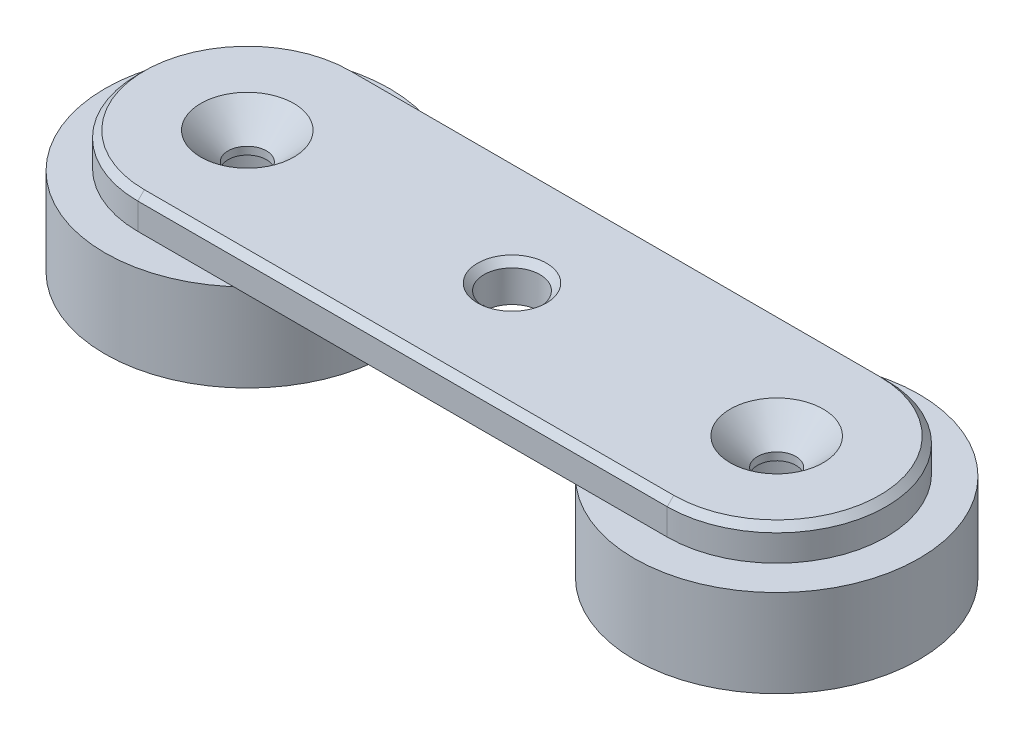
ISO-10303-21;
HEADER;
FILE_DESCRIPTION(('STEP AP214'),'2;1');
FILE_NAME('part.step','',(''),(''),'','','');
FILE_SCHEMA(('AUTOMOTIVE_DESIGN { 1 0 10303 214 1 1 1 1 }'));
ENDSEC;
DATA;
#1=APPLICATION_CONTEXT('core data for automotive mechanical design processes');
#2=APPLICATION_PROTOCOL_DEFINITION('international standard','automotive_design',2000,#1);
#3=PRODUCT_CONTEXT('',#1,'mechanical');
#4=PRODUCT('Part','Part','',(#3));
#5=PRODUCT_RELATED_PRODUCT_CATEGORY('part','',(#4));
#6=PRODUCT_DEFINITION_FORMATION('','',#4);
#7=PRODUCT_DEFINITION_CONTEXT('part definition',#1,'design');
#8=PRODUCT_DEFINITION('design','',#6,#7);
#9=PRODUCT_DEFINITION_SHAPE('','',#8);
#10=(LENGTH_UNIT() NAMED_UNIT(*) SI_UNIT(.MILLI.,.METRE.));
#11=(NAMED_UNIT(*) PLANE_ANGLE_UNIT() SI_UNIT($,.RADIAN.));
#12=(NAMED_UNIT(*) SI_UNIT($,.STERADIAN.) SOLID_ANGLE_UNIT());
#13=UNCERTAINTY_MEASURE_WITH_UNIT(LENGTH_MEASURE(1.E-05),#10,'distance_accuracy_value','');
#14=(GEOMETRIC_REPRESENTATION_CONTEXT(3) GLOBAL_UNCERTAINTY_ASSIGNED_CONTEXT((#13)) GLOBAL_UNIT_ASSIGNED_CONTEXT((#10,
#11,#12)) REPRESENTATION_CONTEXT('',''));
#15=CARTESIAN_POINT('',(0.,0.,0.));
#16=DIRECTION('',(0.,0.,1.));
#17=DIRECTION('',(1.,0.,0.));
#18=AXIS2_PLACEMENT_3D('',#15,#16,#17);
#19=CARTESIAN_POINT('',(24.175,11.4,0.));
#20=DIRECTION('',(0.,1.,0.));
#21=DIRECTION('',(0.,0.,1.));
#22=AXIS2_PLACEMENT_3D('',#19,#20,#21);
#23=PLANE('',#22);
#24=CARTESIAN_POINT('',(-24.175,11.4,0.));
#25=DIRECTION('',(0.,1.,0.));
#26=DIRECTION('',(0.,0.,1.));
#27=AXIS2_PLACEMENT_3D('',#24,#25,#26);
#28=CIRCLE('',#27,7.5);
#29=CARTESIAN_POINT('',(-24.175,11.4,7.50000000000001));
#30=VERTEX_POINT('',#29);
#31=EDGE_CURVE('E190',#30,#30,#28,.F.);
#32=ORIENTED_EDGE('',*,*,#31,.F.);
#33=EDGE_LOOP('',(#32));
#34=FACE_BOUND('',#33,.T.);
#35=CARTESIAN_POINT('',(24.175,11.4,0.));
#36=DIRECTION('',(0.,-1.,0.));
#37=DIRECTION('',(0.,0.,-1.));
#38=AXIS2_PLACEMENT_3D('',#35,#36,#37);
#39=CIRCLE('',#38,7.5);
#40=CARTESIAN_POINT('',(24.175,11.4,-7.50000000000001));
#41=VERTEX_POINT('',#40);
#42=EDGE_CURVE('E187',#41,#41,#39,.T.);
#43=ORIENTED_EDGE('',*,*,#42,.F.);
#44=EDGE_LOOP('',(#43));
#45=FACE_BOUND('',#44,.T.);
#46=DIRECTION('',(-1.,0.,0.));
#47=VECTOR('',#46,1.);
#48=CARTESIAN_POINT('',(10.,11.4,0.));
#49=LINE('',#48,#47);
#50=CARTESIAN_POINT('',(10.,11.4,0.));
#51=VERTEX_POINT('',#50);
#52=CARTESIAN_POINT('',(2.55,11.4,0.));
#53=VERTEX_POINT('',#52);
#54=EDGE_CURVE('E77',#51,#53,#49,.T.);
#55=ORIENTED_EDGE('',*,*,#54,.F.);
#56=CARTESIAN_POINT('',(0.,11.4,0.));
#57=DIRECTION('',(0.,-1.,0.));
#58=DIRECTION('',(0.,0.,-1.));
#59=AXIS2_PLACEMENT_3D('',#56,#57,#58);
#60=CIRCLE('',#59,10.);
#61=CARTESIAN_POINT('',(0.,11.4,-10.));
#62=VERTEX_POINT('',#61);
#63=EDGE_CURVE('E165',#62,#51,#60,.T.);
#64=ORIENTED_EDGE('',*,*,#63,.F.);
#65=DIRECTION('',(-1.,0.,0.));
#66=VECTOR('',#65,1.);
#67=CARTESIAN_POINT('',(24.175,11.4,-10.));
#68=LINE('',#67,#66);
#69=CARTESIAN_POINT('',(24.175,11.4,-10.));
#70=VERTEX_POINT('',#69);
#71=EDGE_CURVE('E197',#70,#62,#68,.T.);
#72=ORIENTED_EDGE('',*,*,#71,.F.);
#73=CARTESIAN_POINT('',(24.175,11.4,0.));
#74=DIRECTION('',(0.,1.,0.));
#75=DIRECTION('',(0.,0.,1.));
#76=AXIS2_PLACEMENT_3D('',#73,#74,#75);
#77=CIRCLE('',#76,10.);
#78=CARTESIAN_POINT('',(24.175,11.4,9.99999999999998));
#79=VERTEX_POINT('',#78);
#80=EDGE_CURVE('E193',#79,#70,#77,.T.);
#81=ORIENTED_EDGE('',*,*,#80,.F.);
#82=DIRECTION('',(1.,0.,0.));
#83=VECTOR('',#82,1.);
#84=CARTESIAN_POINT('',(-24.175,11.4,10.));
#85=LINE('',#84,#83);
#86=CARTESIAN_POINT('',(-24.175,11.4,10.));
#87=VERTEX_POINT('',#86);
#88=EDGE_CURVE('E203',#87,#79,#85,.T.);
#89=ORIENTED_EDGE('',*,*,#88,.F.);
#90=CARTESIAN_POINT('',(-24.175,11.4,0.));
#91=DIRECTION('',(0.,1.,0.));
#92=DIRECTION('',(0.,0.,1.));
#93=AXIS2_PLACEMENT_3D('',#90,#91,#92);
#94=CIRCLE('',#93,10.);
#95=CARTESIAN_POINT('',(-24.175,11.4,-9.99999999999999));
#96=VERTEX_POINT('',#95);
#97=EDGE_CURVE('E200',#96,#87,#94,.T.);
#98=ORIENTED_EDGE('',*,*,#97,.F.);
#99=EDGE_CURVE('E196',#62,#96,#68,.T.);
#100=ORIENTED_EDGE('',*,*,#99,.F.);
#101=CARTESIAN_POINT('',(-9.99999999999998,11.4,0.));
#102=VERTEX_POINT('',#101);
#103=EDGE_CURVE('E84',#102,#62,#60,.T.);
#104=ORIENTED_EDGE('',*,*,#103,.F.);
#105=DIRECTION('',(-1.,0.,0.));
#106=VECTOR('',#105,1.);
#107=CARTESIAN_POINT('',(-2.55,11.4,0.));
#108=LINE('',#107,#106);
#109=CARTESIAN_POINT('',(-2.55,11.4,0.));
#110=VERTEX_POINT('',#109);
#111=EDGE_CURVE('E162',#110,#102,#108,.T.);
#112=ORIENTED_EDGE('',*,*,#111,.F.);
#113=CARTESIAN_POINT('',(0.,11.4,0.));
#114=DIRECTION('',(0.,1.,0.));
#115=DIRECTION('',(0.,0.,1.));
#116=AXIS2_PLACEMENT_3D('',#113,#114,#115);
#117=CIRCLE('',#116,2.55);
#118=EDGE_CURVE('E186',#110,#53,#117,.T.);
#119=ORIENTED_EDGE('',*,*,#118,.T.);
#120=EDGE_LOOP('',(#55,#64,#72,#81,#89,#98,#100,#104,#112,#119));
#121=FACE_BOUND('',#120,.T.);
#122=ADVANCED_FACE('F60',(#34,#45,#121),#23,.F.);
#123=CARTESIAN_POINT('',(24.175,14.4,0.));
#124=DIRECTION('',(0.,1.,0.));
#125=DIRECTION('',(0.,0.,1.));
#126=AXIS2_PLACEMENT_3D('',#123,#124,#125);
#127=PLANE('',#126);
#128=CARTESIAN_POINT('',(-24.175,14.4,0.));
#129=DIRECTION('',(0.,1.,0.));
#130=DIRECTION('',(0.,0.,1.));
#131=AXIS2_PLACEMENT_3D('',#128,#129,#130);
#132=CIRCLE('',#131,9.39999999999999);
#133=CARTESIAN_POINT('',(-24.175,14.4,-9.39999999999998));
#134=VERTEX_POINT('',#133);
#135=CARTESIAN_POINT('',(-24.175,14.4,9.39999999999999));
#136=VERTEX_POINT('',#135);
#137=EDGE_CURVE('E233',#134,#136,#132,.T.);
#138=ORIENTED_EDGE('',*,*,#137,.T.);
#139=DIRECTION('',(1.,0.,0.));
#140=VECTOR('',#139,1.);
#141=CARTESIAN_POINT('',(24.175,14.4,9.39999999999997));
#142=LINE('',#141,#140);
#143=CARTESIAN_POINT('',(24.175,14.4,9.39999999999997));
#144=VERTEX_POINT('',#143);
#145=EDGE_CURVE('E237',#136,#144,#142,.T.);
#146=ORIENTED_EDGE('',*,*,#145,.T.);
#147=CARTESIAN_POINT('',(24.175,14.4,0.));
#148=DIRECTION('',(0.,1.,0.));
#149=DIRECTION('',(0.,0.,1.));
#150=AXIS2_PLACEMENT_3D('',#147,#148,#149);
#151=CIRCLE('',#150,9.39999999999999);
#152=CARTESIAN_POINT('',(24.175,14.4,-9.40000000000001));
#153=VERTEX_POINT('',#152);
#154=EDGE_CURVE('E235',#144,#153,#151,.T.);
#155=ORIENTED_EDGE('',*,*,#154,.T.);
#156=DIRECTION('',(-1.,0.,0.));
#157=VECTOR('',#156,1.);
#158=CARTESIAN_POINT('',(-24.175,14.4,-9.39999999999998));
#159=LINE('',#158,#157);
#160=EDGE_CURVE('E231',#153,#134,#159,.T.);
#161=ORIENTED_EDGE('',*,*,#160,.T.);
#162=EDGE_LOOP('',(#138,#146,#155,#161));
#163=FACE_BOUND('',#162,.T.);
#164=CARTESIAN_POINT('',(0.,14.4,0.));
#165=DIRECTION('',(0.,1.,0.));
#166=DIRECTION('',(0.,0.,1.));
#167=AXIS2_PLACEMENT_3D('',#164,#165,#166);
#168=CIRCLE('',#167,3.14999999999999);
#169=CARTESIAN_POINT('',(0.,14.4,3.15));
#170=VERTEX_POINT('',#169);
#171=EDGE_CURVE('E228',#170,#170,#168,.F.);
#172=ORIENTED_EDGE('',*,*,#171,.T.);
#173=EDGE_LOOP('',(#172));
#174=FACE_BOUND('',#173,.T.);
#175=CARTESIAN_POINT('',(-24.175,14.4,0.));
#176=DIRECTION('',(0.,1.,0.));
#177=DIRECTION('',(0.,0.,1.));
#178=AXIS2_PLACEMENT_3D('',#175,#176,#177);
#179=CIRCLE('',#178,4.25000000000001);
#180=CARTESIAN_POINT('',(-24.175,14.4,4.25000000000002));
#181=VERTEX_POINT('',#180);
#182=EDGE_CURVE('E222',#181,#181,#179,.F.);
#183=ORIENTED_EDGE('',*,*,#182,.T.);
#184=EDGE_LOOP('',(#183));
#185=FACE_BOUND('',#184,.T.);
#186=CARTESIAN_POINT('',(24.175,14.4,0.));
#187=DIRECTION('',(0.,1.,0.));
#188=DIRECTION('',(0.,0.,1.));
#189=AXIS2_PLACEMENT_3D('',#186,#187,#188);
#190=CIRCLE('',#189,4.25000000000001);
#191=CARTESIAN_POINT('',(24.175,14.4,4.25));
#192=VERTEX_POINT('',#191);
#193=EDGE_CURVE('E219',#192,#192,#190,.F.);
#194=ORIENTED_EDGE('',*,*,#193,.T.);
#195=EDGE_LOOP('',(#194));
#196=FACE_BOUND('',#195,.T.);
#197=ADVANCED_FACE('F306',(#163,#174,#185,#196),#127,.T.);
#198=CARTESIAN_POINT('',(24.175,14.4,0.));
#199=DIRECTION('',(0.,-1.,0.));
#200=DIRECTION('',(0.,0.,-1.));
#201=AXIS2_PLACEMENT_3D('',#198,#199,#200);
#202=CYLINDRICAL_SURFACE('',#201,10.);
#203=DIRECTION('',(0.,-1.,0.));
#204=VECTOR('',#203,1.);
#205=CARTESIAN_POINT('',(24.175,14.4,-10.));
#206=LINE('',#205,#204);
#207=CARTESIAN_POINT('',(24.175,13.8,-10.));
#208=VERTEX_POINT('',#207);
#209=EDGE_CURVE('E191',#208,#70,#206,.T.);
#210=ORIENTED_EDGE('',*,*,#209,.F.);
#211=CARTESIAN_POINT('',(24.175,13.8,0.));
#212=DIRECTION('',(0.,1.,0.));
#213=DIRECTION('',(0.,0.,1.));
#214=AXIS2_PLACEMENT_3D('',#211,#212,#213);
#215=CIRCLE('',#214,10.);
#216=CARTESIAN_POINT('',(24.175,13.8,9.99999999999999));
#217=VERTEX_POINT('',#216);
#218=EDGE_CURVE('E243',#208,#217,#215,.F.);
#219=ORIENTED_EDGE('',*,*,#218,.T.);
#220=DIRECTION('',(0.,-1.,0.));
#221=VECTOR('',#220,1.);
#222=CARTESIAN_POINT('',(24.175,14.4,9.99999999999998));
#223=LINE('',#222,#221);
#224=EDGE_CURVE('E206',#217,#79,#223,.T.);
#225=ORIENTED_EDGE('',*,*,#224,.T.);
#226=ORIENTED_EDGE('',*,*,#80,.T.);
#227=EDGE_LOOP('',(#210,#219,#225,#226));
#228=FACE_BOUND('',#227,.T.);
#229=ADVANCED_FACE('F271',(#228),#202,.T.);
#230=CARTESIAN_POINT('',(24.175,14.4,-10.));
#231=DIRECTION('',(0.,0.,1.));
#232=DIRECTION('',(1.,0.,0.));
#233=AXIS2_PLACEMENT_3D('',#230,#231,#232);
#234=PLANE('',#233);
#235=DIRECTION('',(0.,-1.,0.));
#236=VECTOR('',#235,1.);
#237=CARTESIAN_POINT('',(-24.175,14.4,-9.99999999999999));
#238=LINE('',#237,#236);
#239=CARTESIAN_POINT('',(-24.175,13.8,-10.));
#240=VERTEX_POINT('',#239);
#241=EDGE_CURVE('E210',#240,#96,#238,.T.);
#242=ORIENTED_EDGE('',*,*,#241,.F.);
#243=DIRECTION('',(1.,0.,0.));
#244=VECTOR('',#243,1.);
#245=CARTESIAN_POINT('',(24.175,13.8,-10.));
#246=LINE('',#245,#244);
#247=EDGE_CURVE('E69',#240,#208,#246,.T.);
#248=ORIENTED_EDGE('',*,*,#247,.T.);
#249=ORIENTED_EDGE('',*,*,#209,.T.);
#250=ORIENTED_EDGE('',*,*,#71,.T.);
#251=ORIENTED_EDGE('',*,*,#99,.T.);
#252=EDGE_LOOP('',(#242,#248,#249,#250,#251));
#253=FACE_BOUND('',#252,.T.);
#254=ADVANCED_FACE('F268',(#253),#234,.F.);
#255=CARTESIAN_POINT('',(-24.175,14.4,0.));
#256=DIRECTION('',(0.,-1.,0.));
#257=DIRECTION('',(0.,0.,-1.));
#258=AXIS2_PLACEMENT_3D('',#255,#256,#257);
#259=CYLINDRICAL_SURFACE('',#258,10.);
#260=DIRECTION('',(0.,-1.,0.));
#261=VECTOR('',#260,1.);
#262=CARTESIAN_POINT('',(-24.175,14.4,10.));
#263=LINE('',#262,#261);
#264=CARTESIAN_POINT('',(-24.175,13.8,9.99999999999999));
#265=VERTEX_POINT('',#264);
#266=EDGE_CURVE('E208',#265,#87,#263,.T.);
#267=ORIENTED_EDGE('',*,*,#266,.F.);
#268=CARTESIAN_POINT('',(-24.175,13.8,0.));
#269=DIRECTION('',(0.,1.,0.));
#270=DIRECTION('',(0.,0.,1.));
#271=AXIS2_PLACEMENT_3D('',#268,#269,#270);
#272=CIRCLE('',#271,10.);
#273=EDGE_CURVE('E245',#265,#240,#272,.F.);
#274=ORIENTED_EDGE('',*,*,#273,.T.);
#275=ORIENTED_EDGE('',*,*,#241,.T.);
#276=ORIENTED_EDGE('',*,*,#97,.T.);
#277=EDGE_LOOP('',(#267,#274,#275,#276));
#278=FACE_BOUND('',#277,.T.);
#279=ADVANCED_FACE('F301',(#278),#259,.T.);
#280=CARTESIAN_POINT('',(-24.175,14.4,10.));
#281=DIRECTION('',(0.,0.,-1.));
#282=DIRECTION('',(-1.,0.,0.));
#283=AXIS2_PLACEMENT_3D('',#280,#281,#282);
#284=PLANE('',#283);
#285=ORIENTED_EDGE('',*,*,#224,.F.);
#286=DIRECTION('',(-1.,0.,0.));
#287=VECTOR('',#286,1.);
#288=CARTESIAN_POINT('',(-24.175,13.8,9.99999999999999));
#289=LINE('',#288,#287);
#290=EDGE_CURVE('E240',#217,#265,#289,.T.);
#291=ORIENTED_EDGE('',*,*,#290,.T.);
#292=ORIENTED_EDGE('',*,*,#266,.T.);
#293=ORIENTED_EDGE('',*,*,#88,.T.);
#294=EDGE_LOOP('',(#285,#291,#292,#293));
#295=FACE_BOUND('',#294,.T.);
#296=ADVANCED_FACE('F291',(#295),#284,.F.);
#297=CARTESIAN_POINT('',(0.,14.4,0.));
#298=DIRECTION('',(0.,-1.,0.));
#299=DIRECTION('',(0.,0.,-1.));
#300=AXIS2_PLACEMENT_3D('',#297,#298,#299);
#301=CYLINDRICAL_SURFACE('',#300,2.55);
#302=CARTESIAN_POINT('',(0.,13.8,0.));
#303=DIRECTION('',(0.,1.,0.));
#304=DIRECTION('',(0.,0.,1.));
#305=AXIS2_PLACEMENT_3D('',#302,#303,#304);
#306=CIRCLE('',#305,2.55);
#307=CARTESIAN_POINT('',(0.,13.8,2.55));
#308=VERTEX_POINT('',#307);
#309=EDGE_CURVE('E14',#308,#308,#306,.T.);
#310=ORIENTED_EDGE('',*,*,#309,.T.);
#311=EDGE_LOOP('',(#310));
#312=FACE_BOUND('',#311,.T.);
#313=ORIENTED_EDGE('',*,*,#118,.F.);
#314=DIRECTION('',(0.,1.,0.));
#315=VECTOR('',#314,1.);
#316=CARTESIAN_POINT('',(-2.55,10.9,0.));
#317=LINE('',#316,#315);
#318=CARTESIAN_POINT('',(-2.55,10.9,0.));
#319=VERTEX_POINT('',#318);
#320=EDGE_CURVE('E170',#319,#110,#317,.T.);
#321=ORIENTED_EDGE('',*,*,#320,.F.);
#322=CARTESIAN_POINT('',(0.,10.9,0.));
#323=DIRECTION('',(0.,1.,0.));
#324=DIRECTION('',(0.,0.,-1.));
#325=AXIS2_PLACEMENT_3D('',#322,#323,#324);
#326=CIRCLE('',#325,2.55);
#327=CARTESIAN_POINT('',(2.55,10.9,0.));
#328=VERTEX_POINT('',#327);
#329=EDGE_CURVE('E152',#328,#319,#326,.T.);
#330=ORIENTED_EDGE('',*,*,#329,.F.);
#331=DIRECTION('',(0.,1.,0.));
#332=VECTOR('',#331,1.);
#333=CARTESIAN_POINT('',(2.55,10.9,0.));
#334=LINE('',#333,#332);
#335=EDGE_CURVE('E149',#328,#53,#334,.T.);
#336=ORIENTED_EDGE('',*,*,#335,.T.);
#337=EDGE_LOOP('',(#313,#321,#330,#336));
#338=FACE_BOUND('',#337,.T.);
#339=ADVANCED_FACE('F288',(#312,#338),#301,.F.);
#340=CARTESIAN_POINT('',(-24.175,14.4,0.));
#341=DIRECTION('',(0.,-1.,0.));
#342=DIRECTION('',(0.,0.,-1.));
#343=AXIS2_PLACEMENT_3D('',#340,#341,#342);
#344=CYLINDRICAL_SURFACE('',#343,1.75);
#345=CARTESIAN_POINT('',(-24.175,11.9,0.));
#346=DIRECTION('',(0.,1.,0.));
#347=DIRECTION('',(0.,0.,1.));
#348=AXIS2_PLACEMENT_3D('',#345,#346,#347);
#349=CIRCLE('',#348,1.75);
#350=CARTESIAN_POINT('',(-24.175,11.9,1.75000000000001));
#351=VERTEX_POINT('',#350);
#352=EDGE_CURVE('E216',#351,#351,#349,.T.);
#353=ORIENTED_EDGE('',*,*,#352,.T.);
#354=EDGE_LOOP('',(#353));
#355=FACE_BOUND('',#354,.T.);
#356=CARTESIAN_POINT('',(-24.175,11.2,0.));
#357=DIRECTION('',(0.,-1.,0.));
#358=DIRECTION('',(0.,0.,-1.));
#359=AXIS2_PLACEMENT_3D('',#356,#357,#358);
#360=CIRCLE('',#359,1.75);
#361=CARTESIAN_POINT('',(-24.175,11.2,-1.74999999999999));
#362=VERTEX_POINT('',#361);
#363=EDGE_CURVE('E174',#362,#362,#360,.T.);
#364=ORIENTED_EDGE('',*,*,#363,.T.);
#365=EDGE_LOOP('',(#364));
#366=FACE_BOUND('',#365,.T.);
#367=ADVANCED_FACE('F290',(#355,#366),#344,.F.);
#368=CARTESIAN_POINT('',(24.175,14.4,0.));
#369=DIRECTION('',(0.,-1.,0.));
#370=DIRECTION('',(0.,0.,-1.));
#371=AXIS2_PLACEMENT_3D('',#368,#369,#370);
#372=CYLINDRICAL_SURFACE('',#371,1.75);
#373=CARTESIAN_POINT('',(24.175,11.9,0.));
#374=DIRECTION('',(0.,1.,0.));
#375=DIRECTION('',(0.,0.,1.));
#376=AXIS2_PLACEMENT_3D('',#373,#374,#375);
#377=CIRCLE('',#376,1.75);
#378=CARTESIAN_POINT('',(24.175,11.9,1.74999999999999));
#379=VERTEX_POINT('',#378);
#380=EDGE_CURVE('E225',#379,#379,#377,.T.);
#381=ORIENTED_EDGE('',*,*,#380,.T.);
#382=EDGE_LOOP('',(#381));
#383=FACE_BOUND('',#382,.T.);
#384=CARTESIAN_POINT('',(24.175,11.2,0.));
#385=DIRECTION('',(0.,-1.,0.));
#386=DIRECTION('',(0.,0.,-1.));
#387=AXIS2_PLACEMENT_3D('',#384,#385,#386);
#388=CIRCLE('',#387,1.75);
#389=CARTESIAN_POINT('',(24.175,11.2,-1.75000000000001));
#390=VERTEX_POINT('',#389);
#391=EDGE_CURVE('E180',#390,#390,#388,.T.);
#392=ORIENTED_EDGE('',*,*,#391,.T.);
#393=EDGE_LOOP('',(#392));
#394=FACE_BOUND('',#393,.T.);
#395=ADVANCED_FACE('F298',(#383,#394),#372,.F.);
#396=CARTESIAN_POINT('',(24.175,11.2,0.));
#397=DIRECTION('',(0.,-1.,0.));
#398=DIRECTION('',(0.,0.,-1.));
#399=AXIS2_PLACEMENT_3D('',#396,#397,#398);
#400=PLANE('',#399);
#401=CARTESIAN_POINT('',(24.175,11.2,0.));
#402=DIRECTION('',(0.,-1.,0.));
#403=DIRECTION('',(0.,0.,-1.));
#404=AXIS2_PLACEMENT_3D('',#401,#402,#403);
#405=CIRCLE('',#404,7.5);
#406=CARTESIAN_POINT('',(24.175,11.2,-7.50000000000001));
#407=VERTEX_POINT('',#406);
#408=EDGE_CURVE('E183',#407,#407,#405,.T.);
#409=ORIENTED_EDGE('',*,*,#408,.T.);
#410=EDGE_LOOP('',(#409));
#411=FACE_BOUND('',#410,.T.);
#412=ORIENTED_EDGE('',*,*,#391,.F.);
#413=EDGE_LOOP('',(#412));
#414=FACE_BOUND('',#413,.T.);
#415=ADVANCED_FACE('F398',(#411,#414),#400,.T.);
#416=CARTESIAN_POINT('',(24.175,11.2,0.));
#417=DIRECTION('',(0.,1.,0.));
#418=DIRECTION('',(0.,0.,1.));
#419=AXIS2_PLACEMENT_3D('',#416,#417,#418);
#420=CYLINDRICAL_SURFACE('',#419,7.5);
#421=ORIENTED_EDGE('',*,*,#408,.F.);
#422=EDGE_LOOP('',(#421));
#423=FACE_BOUND('',#422,.T.);
#424=ORIENTED_EDGE('',*,*,#42,.T.);
#425=EDGE_LOOP('',(#424));
#426=FACE_BOUND('',#425,.T.);
#427=ADVANCED_FACE('F393',(#423,#426),#420,.T.);
#428=CARTESIAN_POINT('',(-24.175,11.2,0.));
#429=DIRECTION('',(0.,-1.,0.));
#430=DIRECTION('',(0.,0.,-1.));
#431=AXIS2_PLACEMENT_3D('',#428,#429,#430);
#432=PLANE('',#431);
#433=CARTESIAN_POINT('',(-24.175,11.2,0.));
#434=DIRECTION('',(0.,-1.,0.));
#435=DIRECTION('',(0.,0.,-1.));
#436=AXIS2_PLACEMENT_3D('',#433,#434,#435);
#437=CIRCLE('',#436,7.5);
#438=CARTESIAN_POINT('',(-24.175,11.2,-7.49999999999999));
#439=VERTEX_POINT('',#438);
#440=EDGE_CURVE('E177',#439,#439,#437,.T.);
#441=ORIENTED_EDGE('',*,*,#440,.T.);
#442=EDGE_LOOP('',(#441));
#443=FACE_BOUND('',#442,.T.);
#444=ORIENTED_EDGE('',*,*,#363,.F.);
#445=EDGE_LOOP('',(#444));
#446=FACE_BOUND('',#445,.T.);
#447=ADVANCED_FACE('F390',(#443,#446),#432,.T.);
#448=CARTESIAN_POINT('',(-24.175,11.2,0.));
#449=DIRECTION('',(0.,1.,0.));
#450=DIRECTION('',(0.,0.,1.));
#451=AXIS2_PLACEMENT_3D('',#448,#449,#450);
#452=CYLINDRICAL_SURFACE('',#451,7.5);
#453=ORIENTED_EDGE('',*,*,#440,.F.);
#454=EDGE_LOOP('',(#453));
#455=FACE_BOUND('',#454,.T.);
#456=ORIENTED_EDGE('',*,*,#31,.T.);
#457=EDGE_LOOP('',(#456));
#458=FACE_BOUND('',#457,.T.);
#459=ADVANCED_FACE('F327',(#455,#458),#452,.T.);
#460=CARTESIAN_POINT('',(-24.175,11.9,0.));
#461=DIRECTION('',(0.,1.,0.));
#462=DIRECTION('',(0.,0.,1.));
#463=AXIS2_PLACEMENT_3D('',#460,#461,#462);
#464=CONICAL_SURFACE('',#463,1.75,0.78539816339745);
#465=ORIENTED_EDGE('',*,*,#182,.F.);
#466=EDGE_LOOP('',(#465));
#467=FACE_BOUND('',#466,.T.);
#468=ORIENTED_EDGE('',*,*,#352,.F.);
#469=EDGE_LOOP('',(#468));
#470=FACE_BOUND('',#469,.T.);
#471=ADVANCED_FACE('F323',(#467,#470),#464,.F.);
#472=CARTESIAN_POINT('',(24.175,11.9,0.));
#473=DIRECTION('',(0.,1.,0.));
#474=DIRECTION('',(0.,0.,1.));
#475=AXIS2_PLACEMENT_3D('',#472,#473,#474);
#476=CONICAL_SURFACE('',#475,1.75,0.78539816339745);
#477=ORIENTED_EDGE('',*,*,#193,.F.);
#478=EDGE_LOOP('',(#477));
#479=FACE_BOUND('',#478,.T.);
#480=ORIENTED_EDGE('',*,*,#380,.F.);
#481=EDGE_LOOP('',(#480));
#482=FACE_BOUND('',#481,.T.);
#483=ADVANCED_FACE('F326',(#479,#482),#476,.F.);
#484=CARTESIAN_POINT('',(24.175,14.4,-9.40000000000001));
#485=DIRECTION('',(0.,0.707106781186543,-0.707106781186552));
#486=DIRECTION('',(1.,0.,0.));
#487=AXIS2_PLACEMENT_3D('',#484,#485,#486);
#488=PLANE('',#487);
#489=DIRECTION('',(0.,0.707106781186552,0.707106781186543));
#490=VECTOR('',#489,1.);
#491=CARTESIAN_POINT('',(24.175,13.8,-10.));
#492=LINE('',#491,#490);
#493=EDGE_CURVE('E248',#208,#153,#492,.T.);
#494=ORIENTED_EDGE('',*,*,#493,.F.);
#495=ORIENTED_EDGE('',*,*,#247,.F.);
#496=DIRECTION('',(0.,-0.707106781186552,-0.707106781186543));
#497=VECTOR('',#496,1.);
#498=CARTESIAN_POINT('',(-24.175,14.4,-9.39999999999998));
#499=LINE('',#498,#497);
#500=EDGE_CURVE('E64',#134,#240,#499,.T.);
#501=ORIENTED_EDGE('',*,*,#500,.F.);
#502=ORIENTED_EDGE('',*,*,#160,.F.);
#503=EDGE_LOOP('',(#494,#495,#501,#502));
#504=FACE_BOUND('',#503,.T.);
#505=ADVANCED_FACE('F264',(#504),#488,.T.);
#506=CARTESIAN_POINT('',(-24.175,14.4,0.));
#507=DIRECTION('',(0.,-1.,0.));
#508=DIRECTION('',(0.,0.,-1.));
#509=AXIS2_PLACEMENT_3D('',#506,#507,#508);
#510=CONICAL_SURFACE('',#509,9.39999999999999,0.785398163397443);
#511=ORIENTED_EDGE('',*,*,#500,.T.);
#512=ORIENTED_EDGE('',*,*,#273,.F.);
#513=DIRECTION('',(0.,-0.707106781186552,0.707106781186543));
#514=VECTOR('',#513,1.);
#515=CARTESIAN_POINT('',(-24.175,14.4,9.39999999999999));
#516=LINE('',#515,#514);
#517=EDGE_CURVE('E168',#136,#265,#516,.T.);
#518=ORIENTED_EDGE('',*,*,#517,.F.);
#519=ORIENTED_EDGE('',*,*,#137,.F.);
#520=EDGE_LOOP('',(#511,#512,#518,#519));
#521=FACE_BOUND('',#520,.T.);
#522=ADVANCED_FACE('F259',(#521),#510,.T.);
#523=CARTESIAN_POINT('',(24.175,14.4,0.));
#524=DIRECTION('',(0.,-1.,0.));
#525=DIRECTION('',(0.,0.,-1.));
#526=AXIS2_PLACEMENT_3D('',#523,#524,#525);
#527=CONICAL_SURFACE('',#526,9.39999999999999,0.785398163397443);
#528=ORIENTED_EDGE('',*,*,#493,.T.);
#529=ORIENTED_EDGE('',*,*,#154,.F.);
#530=DIRECTION('',(0.,0.707106781186552,-0.707106781186543));
#531=VECTOR('',#530,1.);
#532=CARTESIAN_POINT('',(24.175,13.8,9.99999999999999));
#533=LINE('',#532,#531);
#534=EDGE_CURVE('E166',#217,#144,#533,.T.);
#535=ORIENTED_EDGE('',*,*,#534,.F.);
#536=ORIENTED_EDGE('',*,*,#218,.F.);
#537=EDGE_LOOP('',(#528,#529,#535,#536));
#538=FACE_BOUND('',#537,.T.);
#539=ADVANCED_FACE('F335',(#538),#527,.T.);
#540=CARTESIAN_POINT('',(24.175,14.4,9.39999999999997));
#541=DIRECTION('',(0.,0.707106781186543,0.707106781186552));
#542=DIRECTION('',(-1.,0.,0.));
#543=AXIS2_PLACEMENT_3D('',#540,#541,#542);
#544=PLANE('',#543);
#545=ORIENTED_EDGE('',*,*,#517,.T.);
#546=ORIENTED_EDGE('',*,*,#290,.F.);
#547=ORIENTED_EDGE('',*,*,#534,.T.);
#548=ORIENTED_EDGE('',*,*,#145,.F.);
#549=EDGE_LOOP('',(#545,#546,#547,#548));
#550=FACE_BOUND('',#549,.T.);
#551=ADVANCED_FACE('F332',(#550),#544,.T.);
#552=CARTESIAN_POINT('',(0.,13.8,0.));
#553=DIRECTION('',(0.,1.,0.));
#554=DIRECTION('',(0.,0.,1.));
#555=AXIS2_PLACEMENT_3D('',#552,#553,#554);
#556=CONICAL_SURFACE('',#555,2.55,0.785398163397449);
#557=ORIENTED_EDGE('',*,*,#171,.F.);
#558=EDGE_LOOP('',(#557));
#559=FACE_BOUND('',#558,.T.);
#560=ORIENTED_EDGE('',*,*,#309,.F.);
#561=EDGE_LOOP('',(#560));
#562=FACE_BOUND('',#561,.T.);
#563=ADVANCED_FACE('F62',(#559,#562),#556,.F.);
#564=CARTESIAN_POINT('',(0.,10.9,0.));
#565=DIRECTION('',(0.,1.,0.));
#566=DIRECTION('',(0.,0.,1.));
#567=AXIS2_PLACEMENT_3D('',#564,#565,#566);
#568=CYLINDRICAL_SURFACE('',#567,10.);
#569=ORIENTED_EDGE('',*,*,#103,.T.);
#570=ORIENTED_EDGE('',*,*,#63,.T.);
#571=DIRECTION('',(0.,1.,0.));
#572=VECTOR('',#571,1.);
#573=CARTESIAN_POINT('',(10.,10.9,0.));
#574=LINE('',#573,#572);
#575=CARTESIAN_POINT('',(10.,10.9,0.));
#576=VERTEX_POINT('',#575);
#577=EDGE_CURVE('E147',#576,#51,#574,.T.);
#578=ORIENTED_EDGE('',*,*,#577,.F.);
#579=CARTESIAN_POINT('',(0.,10.9,0.));
#580=DIRECTION('',(0.,-1.,0.));
#581=DIRECTION('',(0.,0.,-1.));
#582=AXIS2_PLACEMENT_3D('',#579,#580,#581);
#583=CIRCLE('',#582,10.);
#584=CARTESIAN_POINT('',(-9.99999999999999,10.9,0.));
#585=VERTEX_POINT('',#584);
#586=EDGE_CURVE('E153',#585,#576,#583,.T.);
#587=ORIENTED_EDGE('',*,*,#586,.F.);
#588=DIRECTION('',(0.,1.,0.));
#589=VECTOR('',#588,1.);
#590=CARTESIAN_POINT('',(-9.99999999999999,10.9,0.));
#591=LINE('',#590,#589);
#592=EDGE_CURVE('E276',#585,#102,#591,.T.);
#593=ORIENTED_EDGE('',*,*,#592,.T.);
#594=EDGE_LOOP('',(#569,#570,#578,#587,#593));
#595=FACE_BOUND('',#594,.T.);
#596=ADVANCED_FACE('F164',(#595),#568,.T.);
#597=CARTESIAN_POINT('',(10.,10.9,0.));
#598=DIRECTION('',(0.,0.,-1.));
#599=DIRECTION('',(-1.,0.,0.));
#600=AXIS2_PLACEMENT_3D('',#597,#598,#599);
#601=PLANE('',#600);
#602=ORIENTED_EDGE('',*,*,#54,.T.);
#603=ORIENTED_EDGE('',*,*,#335,.F.);
#604=DIRECTION('',(-1.,0.,0.));
#605=VECTOR('',#604,1.);
#606=CARTESIAN_POINT('',(10.,10.9,0.));
#607=LINE('',#606,#605);
#608=EDGE_CURVE('E143',#576,#328,#607,.T.);
#609=ORIENTED_EDGE('',*,*,#608,.F.);
#610=ORIENTED_EDGE('',*,*,#577,.T.);
#611=EDGE_LOOP('',(#602,#603,#609,#610));
#612=FACE_BOUND('',#611,.T.);
#613=ADVANCED_FACE('F145',(#612),#601,.F.);
#614=CARTESIAN_POINT('',(-2.55,10.9,0.));
#615=DIRECTION('',(0.,0.,-1.));
#616=DIRECTION('',(-1.,0.,0.));
#617=AXIS2_PLACEMENT_3D('',#614,#615,#616);
#618=PLANE('',#617);
#619=ORIENTED_EDGE('',*,*,#111,.T.);
#620=ORIENTED_EDGE('',*,*,#592,.F.);
#621=DIRECTION('',(-1.,0.,0.));
#622=VECTOR('',#621,1.);
#623=CARTESIAN_POINT('',(-2.55,10.9,0.));
#624=LINE('',#623,#622);
#625=EDGE_CURVE('E158',#319,#585,#624,.T.);
#626=ORIENTED_EDGE('',*,*,#625,.F.);
#627=ORIENTED_EDGE('',*,*,#320,.T.);
#628=EDGE_LOOP('',(#619,#620,#626,#627));
#629=FACE_BOUND('',#628,.T.);
#630=ADVANCED_FACE('F286',(#629),#618,.F.);
#631=CARTESIAN_POINT('',(0.,10.9,0.));
#632=DIRECTION('',(0.,-1.,0.));
#633=DIRECTION('',(0.,0.,-1.));
#634=AXIS2_PLACEMENT_3D('',#631,#632,#633);
#635=PLANE('',#634);
#636=ORIENTED_EDGE('',*,*,#586,.T.);
#637=ORIENTED_EDGE('',*,*,#608,.T.);
#638=ORIENTED_EDGE('',*,*,#329,.T.);
#639=ORIENTED_EDGE('',*,*,#625,.T.);
#640=EDGE_LOOP('',(#636,#637,#638,#639));
#641=FACE_BOUND('',#640,.T.);
#642=ADVANCED_FACE('F156',(#641),#635,.T.);
#643=CLOSED_SHELL('',(#122,#197,#229,#254,#279,#296,#339,#367,#395,#415,#427,#447,#459,#471,
#483,#505,#522,#539,#551,#563,#596,#613,#630,#642));
#644=MANIFOLD_SOLID_BREP('B2',#643);
#645=CARTESIAN_POINT('',(24.175,11.2,0.));
#646=DIRECTION('',(0.,1.,0.));
#647=DIRECTION('',(0.,0.,1.));
#648=AXIS2_PLACEMENT_3D('',#645,#646,#647);
#649=PLANE('',#648);
#650=CARTESIAN_POINT('',(24.175,11.2,0.));
#651=DIRECTION('',(0.,-1.,0.));
#652=DIRECTION('',(0.,0.,1.));
#653=AXIS2_PLACEMENT_3D('',#650,#651,#652);
#654=CIRCLE('',#653,13.);
#655=CARTESIAN_POINT('',(24.175,11.2,13.));
#656=VERTEX_POINT('',#655);
#657=EDGE_CURVE('E59',#656,#656,#654,.T.);
#658=ORIENTED_EDGE('',*,*,#657,.F.);
#659=EDGE_LOOP('',(#658));
#660=FACE_BOUND('',#659,.T.);
#661=CARTESIAN_POINT('',(24.175,11.2,0.));
#662=DIRECTION('',(0.,-1.,0.));
#663=DIRECTION('',(0.,0.,1.));
#664=AXIS2_PLACEMENT_3D('',#661,#662,#663);
#665=CIRCLE('',#664,5.);
#666=CARTESIAN_POINT('',(24.175,11.2,5.00000000000001));
#667=VERTEX_POINT('',#666);
#668=EDGE_CURVE('E517',#667,#667,#665,.T.);
#669=ORIENTED_EDGE('',*,*,#668,.T.);
#670=EDGE_LOOP('',(#669));
#671=FACE_BOUND('',#670,.T.);
#672=ADVANCED_FACE('F506',(#660,#671),#649,.T.);
#673=CARTESIAN_POINT('',(24.175,3.2,0.));
#674=DIRECTION('',(0.,1.,0.));
#675=DIRECTION('',(0.,0.,1.));
#676=AXIS2_PLACEMENT_3D('',#673,#674,#675);
#677=PLANE('',#676);
#678=CARTESIAN_POINT('',(24.175,3.2,0.));
#679=DIRECTION('',(0.,-1.,0.));
#680=DIRECTION('',(0.,0.,1.));
#681=AXIS2_PLACEMENT_3D('',#678,#679,#680);
#682=CIRCLE('',#681,13.);
#683=CARTESIAN_POINT('',(24.175,3.2,13.));
#684=VERTEX_POINT('',#683);
#685=EDGE_CURVE('E510',#684,#684,#682,.T.);
#686=ORIENTED_EDGE('',*,*,#685,.T.);
#687=EDGE_LOOP('',(#686));
#688=FACE_BOUND('',#687,.T.);
#689=CARTESIAN_POINT('',(24.175,3.2,0.));
#690=DIRECTION('',(0.,-1.,0.));
#691=DIRECTION('',(0.,0.,1.));
#692=AXIS2_PLACEMENT_3D('',#689,#690,#691);
#693=CIRCLE('',#692,5.);
#694=CARTESIAN_POINT('',(24.175,3.2,5.00000000000001));
#695=VERTEX_POINT('',#694);
#696=EDGE_CURVE('E519',#695,#695,#693,.T.);
#697=ORIENTED_EDGE('',*,*,#696,.F.);
#698=EDGE_LOOP('',(#697));
#699=FACE_BOUND('',#698,.T.);
#700=ADVANCED_FACE('F532',(#688,#699),#677,.F.);
#701=CARTESIAN_POINT('',(24.175,11.2,0.));
#702=DIRECTION('',(0.,-1.,0.));
#703=DIRECTION('',(0.,0.,-1.));
#704=AXIS2_PLACEMENT_3D('',#701,#702,#703);
#705=CYLINDRICAL_SURFACE('',#704,13.);
#706=ORIENTED_EDGE('',*,*,#657,.T.);
#707=EDGE_LOOP('',(#706));
#708=FACE_BOUND('',#707,.T.);
#709=ORIENTED_EDGE('',*,*,#685,.F.);
#710=EDGE_LOOP('',(#709));
#711=FACE_BOUND('',#710,.T.);
#712=ADVANCED_FACE('F508',(#708,#711),#705,.T.);
#713=CARTESIAN_POINT('',(24.175,11.2,0.));
#714=DIRECTION('',(0.,-1.,0.));
#715=DIRECTION('',(0.,0.,-1.));
#716=AXIS2_PLACEMENT_3D('',#713,#714,#715);
#717=CYLINDRICAL_SURFACE('',#716,5.);
#718=ORIENTED_EDGE('',*,*,#668,.F.);
#719=EDGE_LOOP('',(#718));
#720=FACE_BOUND('',#719,.T.);
#721=ORIENTED_EDGE('',*,*,#696,.T.);
#722=EDGE_LOOP('',(#721));
#723=FACE_BOUND('',#722,.T.);
#724=ADVANCED_FACE('F526',(#720,#723),#717,.F.);
#725=CLOSED_SHELL('',(#672,#700,#712,#724));
#726=MANIFOLD_SOLID_BREP('B8_NOT_SHOWN',#725);
#727=CARTESIAN_POINT('',(-24.175,11.2,0.));
#728=DIRECTION('',(0.,1.,0.));
#729=DIRECTION('',(0.,0.,1.));
#730=AXIS2_PLACEMENT_3D('',#727,#728,#729);
#731=PLANE('',#730);
#732=CARTESIAN_POINT('',(-24.175,11.2,0.));
#733=DIRECTION('',(0.,1.,0.));
#734=DIRECTION('',(0.,0.,1.));
#735=AXIS2_PLACEMENT_3D('',#732,#733,#734);
#736=CIRCLE('',#735,13.);
#737=CARTESIAN_POINT('',(-24.175,11.2,13.));
#738=VERTEX_POINT('',#737);
#739=EDGE_CURVE('E505',#738,#738,#736,.T.);
#740=ORIENTED_EDGE('',*,*,#739,.T.);
#741=EDGE_LOOP('',(#740));
#742=FACE_BOUND('',#741,.T.);
#743=CARTESIAN_POINT('',(-24.175,11.2,0.));
#744=DIRECTION('',(0.,1.,0.));
#745=DIRECTION('',(0.,0.,1.));
#746=AXIS2_PLACEMENT_3D('',#743,#744,#745);
#747=CIRCLE('',#746,5.);
#748=CARTESIAN_POINT('',(-24.175,11.2,5.00000000000001));
#749=VERTEX_POINT('',#748);
#750=EDGE_CURVE('E597',#749,#749,#747,.T.);
#751=ORIENTED_EDGE('',*,*,#750,.F.);
#752=EDGE_LOOP('',(#751));
#753=FACE_BOUND('',#752,.T.);
#754=ADVANCED_FACE('F586',(#742,#753),#731,.T.);
#755=CARTESIAN_POINT('',(-24.175,3.2,0.));
#756=DIRECTION('',(0.,1.,0.));
#757=DIRECTION('',(0.,0.,1.));
#758=AXIS2_PLACEMENT_3D('',#755,#756,#757);
#759=PLANE('',#758);
#760=CARTESIAN_POINT('',(-24.175,3.2,0.));
#761=DIRECTION('',(0.,1.,0.));
#762=DIRECTION('',(0.,0.,1.));
#763=AXIS2_PLACEMENT_3D('',#760,#761,#762);
#764=CIRCLE('',#763,13.);
#765=CARTESIAN_POINT('',(-24.175,3.2,13.));
#766=VERTEX_POINT('',#765);
#767=EDGE_CURVE('E590',#766,#766,#764,.T.);
#768=ORIENTED_EDGE('',*,*,#767,.F.);
#769=EDGE_LOOP('',(#768));
#770=FACE_BOUND('',#769,.T.);
#771=CARTESIAN_POINT('',(-24.175,3.2,0.));
#772=DIRECTION('',(0.,1.,0.));
#773=DIRECTION('',(0.,0.,1.));
#774=AXIS2_PLACEMENT_3D('',#771,#772,#773);
#775=CIRCLE('',#774,5.);
#776=CARTESIAN_POINT('',(-24.175,3.2,5.00000000000001));
#777=VERTEX_POINT('',#776);
#778=EDGE_CURVE('E599',#777,#777,#775,.T.);
#779=ORIENTED_EDGE('',*,*,#778,.T.);
#780=EDGE_LOOP('',(#779));
#781=FACE_BOUND('',#780,.T.);
#782=ADVANCED_FACE('F609',(#770,#781),#759,.F.);
#783=CARTESIAN_POINT('',(-24.175,11.2,0.));
#784=DIRECTION('',(0.,-1.,0.));
#785=DIRECTION('',(0.,0.,-1.));
#786=AXIS2_PLACEMENT_3D('',#783,#784,#785);
#787=CYLINDRICAL_SURFACE('',#786,13.);
#788=ORIENTED_EDGE('',*,*,#739,.F.);
#789=EDGE_LOOP('',(#788));
#790=FACE_BOUND('',#789,.T.);
#791=ORIENTED_EDGE('',*,*,#767,.T.);
#792=EDGE_LOOP('',(#791));
#793=FACE_BOUND('',#792,.T.);
#794=ADVANCED_FACE('F588',(#790,#793),#787,.T.);
#795=CARTESIAN_POINT('',(-24.175,11.2,0.));
#796=DIRECTION('',(0.,-1.,0.));
#797=DIRECTION('',(0.,0.,-1.));
#798=AXIS2_PLACEMENT_3D('',#795,#796,#797);
#799=CYLINDRICAL_SURFACE('',#798,5.);
#800=ORIENTED_EDGE('',*,*,#750,.T.);
#801=EDGE_LOOP('',(#800));
#802=FACE_BOUND('',#801,.T.);
#803=ORIENTED_EDGE('',*,*,#778,.F.);
#804=EDGE_LOOP('',(#803));
#805=FACE_BOUND('',#804,.T.);
#806=ADVANCED_FACE('F605',(#802,#805),#799,.F.);
#807=CLOSED_SHELL('',(#754,#782,#794,#806));
#808=MANIFOLD_SOLID_BREP('B54_NOT_SHOWN',#807);
#809=ADVANCED_BREP_SHAPE_REPRESENTATION('',(#18,#644,#726,#808),#14);
#810=SHAPE_DEFINITION_REPRESENTATION(#9,#809);
ENDSEC;
END-ISO-10303-21;
